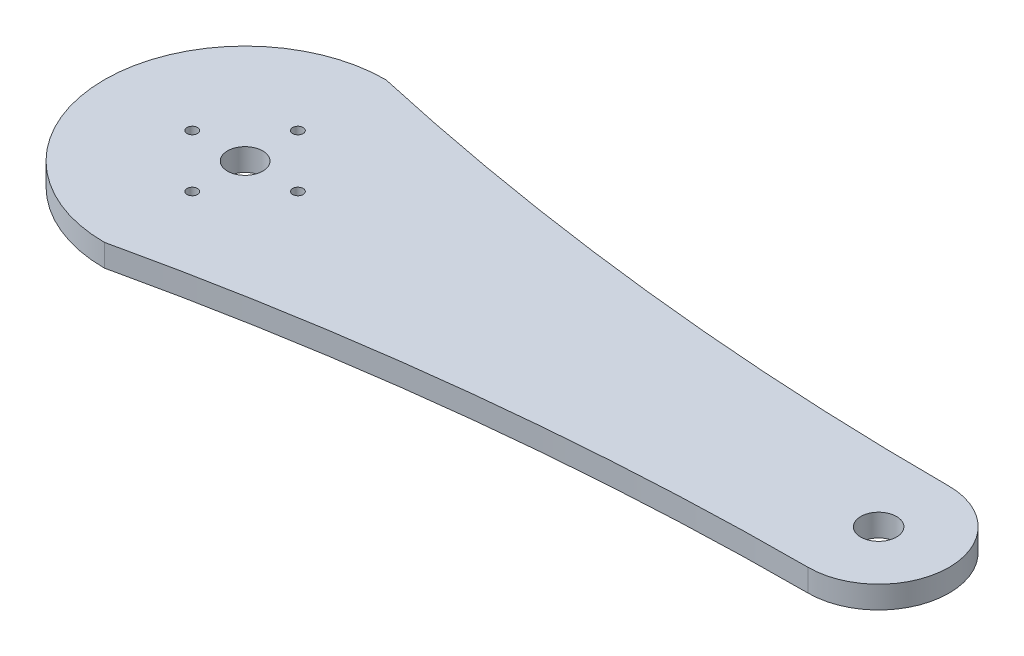
ISO-10303-21;
HEADER;
FILE_DESCRIPTION(('STEP AP214'),'2;1');
FILE_NAME('part.step','',(''),(''),'','','');
FILE_SCHEMA(('AUTOMOTIVE_DESIGN { 1 0 10303 214 1 1 1 1 }'));
ENDSEC;
DATA;
#1=APPLICATION_CONTEXT('core data for automotive mechanical design processes');
#2=APPLICATION_PROTOCOL_DEFINITION('international standard','automotive_design',2000,#1);
#3=PRODUCT_CONTEXT('',#1,'mechanical');
#4=PRODUCT('Part','Part','',(#3));
#5=PRODUCT_RELATED_PRODUCT_CATEGORY('part','',(#4));
#6=PRODUCT_DEFINITION_FORMATION('','',#4);
#7=PRODUCT_DEFINITION_CONTEXT('part definition',#1,'design');
#8=PRODUCT_DEFINITION('design','',#6,#7);
#9=PRODUCT_DEFINITION_SHAPE('','',#8);
#10=(LENGTH_UNIT() NAMED_UNIT(*) SI_UNIT(.MILLI.,.METRE.));
#11=(NAMED_UNIT(*) PLANE_ANGLE_UNIT() SI_UNIT($,.RADIAN.));
#12=(NAMED_UNIT(*) SI_UNIT($,.STERADIAN.) SOLID_ANGLE_UNIT());
#13=UNCERTAINTY_MEASURE_WITH_UNIT(LENGTH_MEASURE(1.E-05),#10,'distance_accuracy_value','');
#14=(GEOMETRIC_REPRESENTATION_CONTEXT(3) GLOBAL_UNCERTAINTY_ASSIGNED_CONTEXT((#13)) GLOBAL_UNIT_ASSIGNED_CONTEXT((#10,
#11,#12)) REPRESENTATION_CONTEXT('',''));
#15=CARTESIAN_POINT('',(0.,0.,0.));
#16=DIRECTION('',(0.,0.,1.));
#17=DIRECTION('',(1.,0.,0.));
#18=AXIS2_PLACEMENT_3D('',#15,#16,#17);
#19=CARTESIAN_POINT('',(4.627736357,3.175,-210.));
#20=DIRECTION('',(0.,-1.,0.));
#21=DIRECTION('',(0.,0.,-1.));
#22=AXIS2_PLACEMENT_3D('',#19,#20,#21);
#23=PLANE('',#22);
#24=CARTESIAN_POINT('',(49.627736357,3.175,0.));
#25=DIRECTION('',(0.,1.,0.));
#26=DIRECTION('',(0.,0.,1.));
#27=AXIS2_PLACEMENT_3D('',#24,#25,#26);
#28=CIRCLE('',#27,2.54);
#29=CARTESIAN_POINT('',(49.627736357,3.175,2.54));
#30=VERTEX_POINT('',#29);
#31=EDGE_CURVE('E173',#30,#30,#28,.T.);
#32=ORIENTED_EDGE('',*,*,#31,.F.);
#33=EDGE_LOOP('',(#32));
#34=FACE_BOUND('',#33,.T.);
#35=CARTESIAN_POINT('',(49.627736357,3.175,-420.));
#36=DIRECTION('',(0.,-1.,0.));
#37=DIRECTION('',(0.,0.,-1.));
#38=AXIS2_PLACEMENT_3D('',#35,#36,#37);
#39=CIRCLE('',#38,410.);
#40=CARTESIAN_POINT('',(49.627736357,3.175,-10.));
#41=VERTEX_POINT('',#40);
#42=CARTESIAN_POINT('',(-40.372263643,3.175,-20.));
#43=VERTEX_POINT('',#42);
#44=EDGE_CURVE('E11',#41,#43,#39,.T.);
#45=ORIENTED_EDGE('',*,*,#44,.T.);
#46=CARTESIAN_POINT('',(-40.372263643,3.175,0.));
#47=DIRECTION('',(0.,1.,0.));
#48=DIRECTION('',(0.,0.,1.));
#49=AXIS2_PLACEMENT_3D('',#46,#47,#48);
#50=CIRCLE('',#49,20.);
#51=CARTESIAN_POINT('',(-40.372263643,3.175,20.));
#52=VERTEX_POINT('',#51);
#53=EDGE_CURVE('E45',#43,#52,#50,.T.);
#54=ORIENTED_EDGE('',*,*,#53,.T.);
#55=CARTESIAN_POINT('',(49.627736357,3.175,420.));
#56=DIRECTION('',(0.,-1.,0.));
#57=DIRECTION('',(0.,0.,1.));
#58=AXIS2_PLACEMENT_3D('',#55,#56,#57);
#59=CIRCLE('',#58,410.);
#60=CARTESIAN_POINT('',(49.627736357,3.175,10.));
#61=VERTEX_POINT('',#60);
#62=EDGE_CURVE('E119',#52,#61,#59,.T.);
#63=ORIENTED_EDGE('',*,*,#62,.T.);
#64=CARTESIAN_POINT('',(49.627736357,3.175,0.));
#65=DIRECTION('',(0.,1.,0.));
#66=DIRECTION('',(0.,0.,-1.));
#67=AXIS2_PLACEMENT_3D('',#64,#65,#66);
#68=CIRCLE('',#67,10.);
#69=EDGE_CURVE('E117',#61,#41,#68,.T.);
#70=ORIENTED_EDGE('',*,*,#69,.T.);
#71=EDGE_LOOP('',(#45,#54,#63,#70));
#72=FACE_BOUND('',#71,.T.);
#73=CARTESIAN_POINT('',(-40.372263643,3.175,0.));
#74=DIRECTION('',(0.,-1.,0.));
#75=DIRECTION('',(0.,0.,1.));
#76=AXIS2_PLACEMENT_3D('',#73,#74,#75);
#77=CIRCLE('',#76,2.5);
#78=CARTESIAN_POINT('',(-40.372263643,3.175,2.5));
#79=VERTEX_POINT('',#78);
#80=EDGE_CURVE('E113',#79,#79,#77,.T.);
#81=ORIENTED_EDGE('',*,*,#80,.T.);
#82=EDGE_LOOP('',(#81));
#83=FACE_BOUND('',#82,.T.);
#84=CARTESIAN_POINT('',(-32.872263643,3.175,0.));
#85=DIRECTION('',(0.,-1.,0.));
#86=DIRECTION('',(0.,0.,1.));
#87=AXIS2_PLACEMENT_3D('',#84,#85,#86);
#88=CIRCLE('',#87,0.75);
#89=CARTESIAN_POINT('',(-32.872263643,3.175,0.75));
#90=VERTEX_POINT('',#89);
#91=EDGE_CURVE('E110',#90,#90,#88,.T.);
#92=ORIENTED_EDGE('',*,*,#91,.T.);
#93=EDGE_LOOP('',(#92));
#94=FACE_BOUND('',#93,.T.);
#95=CARTESIAN_POINT('',(-47.872263643,3.175,0.));
#96=DIRECTION('',(0.,-1.,0.));
#97=DIRECTION('',(0.,0.,1.));
#98=AXIS2_PLACEMENT_3D('',#95,#96,#97);
#99=CIRCLE('',#98,0.75);
#100=CARTESIAN_POINT('',(-47.872263643,3.175,0.75));
#101=VERTEX_POINT('',#100);
#102=EDGE_CURVE('E121',#101,#101,#99,.T.);
#103=ORIENTED_EDGE('',*,*,#102,.T.);
#104=EDGE_LOOP('',(#103));
#105=FACE_BOUND('',#104,.T.);
#106=CARTESIAN_POINT('',(-40.372263643,3.175,-7.5));
#107=DIRECTION('',(0.,-1.,0.));
#108=DIRECTION('',(0.,0.,1.));
#109=AXIS2_PLACEMENT_3D('',#106,#107,#108);
#110=CIRCLE('',#109,0.75);
#111=CARTESIAN_POINT('',(-40.372263643,3.175,-6.75));
#112=VERTEX_POINT('',#111);
#113=EDGE_CURVE('E134',#112,#112,#110,.T.);
#114=ORIENTED_EDGE('',*,*,#113,.T.);
#115=EDGE_LOOP('',(#114));
#116=FACE_BOUND('',#115,.T.);
#117=CARTESIAN_POINT('',(-40.372263643,3.175,7.5));
#118=DIRECTION('',(0.,-1.,0.));
#119=DIRECTION('',(0.,0.,1.));
#120=AXIS2_PLACEMENT_3D('',#117,#118,#119);
#121=CIRCLE('',#120,0.75);
#122=CARTESIAN_POINT('',(-40.372263643,3.175,8.25));
#123=VERTEX_POINT('',#122);
#124=EDGE_CURVE('E131',#123,#123,#121,.T.);
#125=ORIENTED_EDGE('',*,*,#124,.T.);
#126=EDGE_LOOP('',(#125));
#127=FACE_BOUND('',#126,.T.);
#128=ADVANCED_FACE('F36',(#34,#72,#83,#94,#105,#116,#127),#23,.F.);
#129=CARTESIAN_POINT('',(4.627736357,0.,-210.));
#130=DIRECTION('',(0.,-1.,0.));
#131=DIRECTION('',(0.,0.,-1.));
#132=AXIS2_PLACEMENT_3D('',#129,#130,#131);
#133=PLANE('',#132);
#134=CARTESIAN_POINT('',(49.627736357,0.,0.));
#135=DIRECTION('',(0.,-1.,0.));
#136=DIRECTION('',(0.,0.,-1.));
#137=AXIS2_PLACEMENT_3D('',#134,#135,#136);
#138=CIRCLE('',#137,2.54);
#139=CARTESIAN_POINT('',(49.627736357,0.,-2.54));
#140=VERTEX_POINT('',#139);
#141=EDGE_CURVE('E220',#140,#140,#138,.F.);
#142=ORIENTED_EDGE('',*,*,#141,.T.);
#143=EDGE_LOOP('',(#142));
#144=FACE_BOUND('',#143,.T.);
#145=CARTESIAN_POINT('',(-40.372263643,0.,-7.5));
#146=DIRECTION('',(0.,1.,0.));
#147=DIRECTION('',(0.,0.,1.));
#148=AXIS2_PLACEMENT_3D('',#145,#146,#147);
#149=CIRCLE('',#148,0.75);
#150=CARTESIAN_POINT('',(-40.372263643,0.,-6.75));
#151=VERTEX_POINT('',#150);
#152=EDGE_CURVE('E135',#151,#151,#149,.T.);
#153=ORIENTED_EDGE('',*,*,#152,.T.);
#154=EDGE_LOOP('',(#153));
#155=FACE_BOUND('',#154,.T.);
#156=CARTESIAN_POINT('',(-32.872263643,0.,0.));
#157=DIRECTION('',(0.,1.,0.));
#158=DIRECTION('',(0.,0.,1.));
#159=AXIS2_PLACEMENT_3D('',#156,#157,#158);
#160=CIRCLE('',#159,0.75);
#161=CARTESIAN_POINT('',(-32.872263643,0.,0.75));
#162=VERTEX_POINT('',#161);
#163=EDGE_CURVE('E178',#162,#162,#160,.T.);
#164=ORIENTED_EDGE('',*,*,#163,.T.);
#165=EDGE_LOOP('',(#164));
#166=FACE_BOUND('',#165,.T.);
#167=CARTESIAN_POINT('',(49.627736357,0.,-420.));
#168=DIRECTION('',(0.,1.,0.));
#169=DIRECTION('',(0.,0.,-1.));
#170=AXIS2_PLACEMENT_3D('',#167,#168,#169);
#171=CIRCLE('',#170,410.);
#172=CARTESIAN_POINT('',(-40.372263643,0.,-20.));
#173=VERTEX_POINT('',#172);
#174=CARTESIAN_POINT('',(49.627736357,0.,-10.));
#175=VERTEX_POINT('',#174);
#176=EDGE_CURVE('E130',#173,#175,#171,.T.);
#177=ORIENTED_EDGE('',*,*,#176,.T.);
#178=CARTESIAN_POINT('',(49.627736357,0.,0.));
#179=DIRECTION('',(0.,-1.,0.));
#180=DIRECTION('',(0.,0.,-1.));
#181=AXIS2_PLACEMENT_3D('',#178,#179,#180);
#182=CIRCLE('',#181,10.);
#183=CARTESIAN_POINT('',(49.627736357,0.,10.));
#184=VERTEX_POINT('',#183);
#185=EDGE_CURVE('E127',#175,#184,#182,.T.);
#186=ORIENTED_EDGE('',*,*,#185,.T.);
#187=CARTESIAN_POINT('',(49.627736357,0.,420.));
#188=DIRECTION('',(0.,1.,0.));
#189=DIRECTION('',(0.,0.,1.));
#190=AXIS2_PLACEMENT_3D('',#187,#188,#189);
#191=CIRCLE('',#190,410.);
#192=CARTESIAN_POINT('',(-40.372263643,0.,20.));
#193=VERTEX_POINT('',#192);
#194=EDGE_CURVE('E125',#184,#193,#191,.T.);
#195=ORIENTED_EDGE('',*,*,#194,.T.);
#196=CARTESIAN_POINT('',(-40.372263643,0.,0.));
#197=DIRECTION('',(0.,-1.,0.));
#198=DIRECTION('',(0.,0.,1.));
#199=AXIS2_PLACEMENT_3D('',#196,#197,#198);
#200=CIRCLE('',#199,20.);
#201=EDGE_CURVE('E92',#193,#173,#200,.T.);
#202=ORIENTED_EDGE('',*,*,#201,.T.);
#203=EDGE_LOOP('',(#177,#186,#195,#202));
#204=FACE_BOUND('',#203,.T.);
#205=CARTESIAN_POINT('',(-40.372263643,0.,0.));
#206=DIRECTION('',(0.,1.,0.));
#207=DIRECTION('',(0.,0.,1.));
#208=AXIS2_PLACEMENT_3D('',#205,#206,#207);
#209=CIRCLE('',#208,2.5);
#210=CARTESIAN_POINT('',(-40.372263643,0.,2.5));
#211=VERTEX_POINT('',#210);
#212=EDGE_CURVE('E101',#211,#211,#209,.T.);
#213=ORIENTED_EDGE('',*,*,#212,.T.);
#214=EDGE_LOOP('',(#213));
#215=FACE_BOUND('',#214,.T.);
#216=CARTESIAN_POINT('',(-47.872263643,0.,0.));
#217=DIRECTION('',(0.,1.,0.));
#218=DIRECTION('',(0.,0.,1.));
#219=AXIS2_PLACEMENT_3D('',#216,#217,#218);
#220=CIRCLE('',#219,0.75);
#221=CARTESIAN_POINT('',(-47.872263643,0.,0.75));
#222=VERTEX_POINT('',#221);
#223=EDGE_CURVE('E147',#222,#222,#220,.T.);
#224=ORIENTED_EDGE('',*,*,#223,.T.);
#225=EDGE_LOOP('',(#224));
#226=FACE_BOUND('',#225,.T.);
#227=CARTESIAN_POINT('',(-40.372263643,0.,7.5));
#228=DIRECTION('',(0.,1.,0.));
#229=DIRECTION('',(0.,0.,1.));
#230=AXIS2_PLACEMENT_3D('',#227,#228,#229);
#231=CIRCLE('',#230,0.75);
#232=CARTESIAN_POINT('',(-40.372263643,0.,8.25));
#233=VERTEX_POINT('',#232);
#234=EDGE_CURVE('E39',#233,#233,#231,.T.);
#235=ORIENTED_EDGE('',*,*,#234,.T.);
#236=EDGE_LOOP('',(#235));
#237=FACE_BOUND('',#236,.T.);
#238=ADVANCED_FACE('F180',(#144,#155,#166,#204,#215,#226,#237),#133,.T.);
#239=CARTESIAN_POINT('',(49.627736357,3.175,-420.));
#240=DIRECTION('',(0.,-1.,0.));
#241=DIRECTION('',(0.,0.,-1.));
#242=AXIS2_PLACEMENT_3D('',#239,#240,#241);
#243=CYLINDRICAL_SURFACE('',#242,410.);
#244=ORIENTED_EDGE('',*,*,#176,.F.);
#245=DIRECTION('',(0.,1.,0.));
#246=VECTOR('',#245,1.);
#247=CARTESIAN_POINT('',(-40.372263643,3.175,-20.));
#248=LINE('',#247,#246);
#249=EDGE_CURVE('E190',#173,#43,#248,.T.);
#250=ORIENTED_EDGE('',*,*,#249,.T.);
#251=ORIENTED_EDGE('',*,*,#44,.F.);
#252=DIRECTION('',(0.,-1.,0.));
#253=VECTOR('',#252,1.);
#254=CARTESIAN_POINT('',(49.627736357,3.175,-10.));
#255=LINE('',#254,#253);
#256=EDGE_CURVE('E187',#41,#175,#255,.T.);
#257=ORIENTED_EDGE('',*,*,#256,.T.);
#258=EDGE_LOOP('',(#244,#250,#251,#257));
#259=FACE_BOUND('',#258,.T.);
#260=ADVANCED_FACE('F203',(#259),#243,.F.);
#261=CARTESIAN_POINT('',(-40.372263643,3.175,0.));
#262=DIRECTION('',(0.,-1.,0.));
#263=DIRECTION('',(0.,0.,-1.));
#264=AXIS2_PLACEMENT_3D('',#261,#262,#263);
#265=CYLINDRICAL_SURFACE('',#264,20.);
#266=ORIENTED_EDGE('',*,*,#201,.F.);
#267=DIRECTION('',(0.,1.,0.));
#268=VECTOR('',#267,1.);
#269=CARTESIAN_POINT('',(-40.372263643,3.175,20.));
#270=LINE('',#269,#268);
#271=EDGE_CURVE('E159',#193,#52,#270,.T.);
#272=ORIENTED_EDGE('',*,*,#271,.T.);
#273=ORIENTED_EDGE('',*,*,#53,.F.);
#274=ORIENTED_EDGE('',*,*,#249,.F.);
#275=EDGE_LOOP('',(#266,#272,#273,#274));
#276=FACE_BOUND('',#275,.T.);
#277=ADVANCED_FACE('F237',(#276),#265,.T.);
#278=CARTESIAN_POINT('',(49.627736357,3.175,420.));
#279=DIRECTION('',(0.,-1.,0.));
#280=DIRECTION('',(0.,0.,-1.));
#281=AXIS2_PLACEMENT_3D('',#278,#279,#280);
#282=CYLINDRICAL_SURFACE('',#281,410.);
#283=ORIENTED_EDGE('',*,*,#194,.F.);
#284=DIRECTION('',(0.,1.,0.));
#285=VECTOR('',#284,1.);
#286=CARTESIAN_POINT('',(49.627736357,3.175,10.));
#287=LINE('',#286,#285);
#288=EDGE_CURVE('E153',#184,#61,#287,.T.);
#289=ORIENTED_EDGE('',*,*,#288,.T.);
#290=ORIENTED_EDGE('',*,*,#62,.F.);
#291=ORIENTED_EDGE('',*,*,#271,.F.);
#292=EDGE_LOOP('',(#283,#289,#290,#291));
#293=FACE_BOUND('',#292,.T.);
#294=ADVANCED_FACE('F185',(#293),#282,.F.);
#295=CARTESIAN_POINT('',(49.627736357,3.175,0.));
#296=DIRECTION('',(0.,-1.,0.));
#297=DIRECTION('',(0.,0.,-1.));
#298=AXIS2_PLACEMENT_3D('',#295,#296,#297);
#299=CYLINDRICAL_SURFACE('',#298,10.);
#300=ORIENTED_EDGE('',*,*,#185,.F.);
#301=ORIENTED_EDGE('',*,*,#256,.F.);
#302=ORIENTED_EDGE('',*,*,#69,.F.);
#303=ORIENTED_EDGE('',*,*,#288,.F.);
#304=EDGE_LOOP('',(#300,#301,#302,#303));
#305=FACE_BOUND('',#304,.T.);
#306=ADVANCED_FACE('F200',(#305),#299,.T.);
#307=CARTESIAN_POINT('',(-40.372263643,3.175,0.));
#308=DIRECTION('',(0.,-1.,0.));
#309=DIRECTION('',(0.,0.,-1.));
#310=AXIS2_PLACEMENT_3D('',#307,#308,#309);
#311=CYLINDRICAL_SURFACE('',#310,2.5);
#312=CARTESIAN_POINT('',(-40.372263643,0.,2.5));
#313=CARTESIAN_POINT('',(-40.372263643,3.175,2.5));
#314=(BOUNDED_CURVE() B_SPLINE_CURVE(1,(#312,#313),.UNSPECIFIED.,.F.,
.F.) B_SPLINE_CURVE_WITH_KNOTS((2,2),(-3.175,0.),
.UNSPECIFIED.) CURVE() GEOMETRIC_REPRESENTATION_ITEM() RATIONAL_B_SPLINE_CURVE((1.,1.)) REPRESENTATION_ITEM(''));
#315=EDGE_CURVE('E115',#211,#79,#314,.T.);
#316=ORIENTED_EDGE('',*,*,#315,.F.);
#317=ORIENTED_EDGE('',*,*,#212,.F.);
#318=ORIENTED_EDGE('',*,*,#315,.T.);
#319=ORIENTED_EDGE('',*,*,#80,.F.);
#320=EDGE_LOOP('',(#316,#317,#318,#319));
#321=FACE_BOUND('',#320,.T.);
#322=ADVANCED_FACE('F114',(#321),#311,.F.);
#323=CARTESIAN_POINT('',(-32.872263643,3.175,0.));
#324=DIRECTION('',(0.,-1.,0.));
#325=DIRECTION('',(0.,0.,-1.));
#326=AXIS2_PLACEMENT_3D('',#323,#324,#325);
#327=CYLINDRICAL_SURFACE('',#326,0.75);
#328=CARTESIAN_POINT('',(-32.872263643,0.,0.75));
#329=CARTESIAN_POINT('',(-32.872263643,3.175,0.75));
#330=(BOUNDED_CURVE() B_SPLINE_CURVE(1,(#328,#329),.UNSPECIFIED.,.F.,
.F.) B_SPLINE_CURVE_WITH_KNOTS((2,2),(-3.175,0.),
.UNSPECIFIED.) CURVE() GEOMETRIC_REPRESENTATION_ITEM() RATIONAL_B_SPLINE_CURVE((1.,1.)) REPRESENTATION_ITEM(''));
#331=EDGE_CURVE('E152',#162,#90,#330,.T.);
#332=ORIENTED_EDGE('',*,*,#331,.F.);
#333=ORIENTED_EDGE('',*,*,#163,.F.);
#334=ORIENTED_EDGE('',*,*,#331,.T.);
#335=ORIENTED_EDGE('',*,*,#91,.F.);
#336=EDGE_LOOP('',(#332,#333,#334,#335));
#337=FACE_BOUND('',#336,.T.);
#338=ADVANCED_FACE('F214',(#337),#327,.F.);
#339=CARTESIAN_POINT('',(-47.872263643,3.175,0.));
#340=DIRECTION('',(0.,-1.,0.));
#341=DIRECTION('',(0.,0.,-1.));
#342=AXIS2_PLACEMENT_3D('',#339,#340,#341);
#343=CYLINDRICAL_SURFACE('',#342,0.75);
#344=CARTESIAN_POINT('',(-47.872263643,0.,0.75));
#345=CARTESIAN_POINT('',(-47.872263643,3.175,0.75));
#346=(BOUNDED_CURVE() B_SPLINE_CURVE(1,(#344,#345),.UNSPECIFIED.,.F.,
.F.) B_SPLINE_CURVE_WITH_KNOTS((2,2),(-3.175,0.),
.UNSPECIFIED.) CURVE() GEOMETRIC_REPRESENTATION_ITEM() RATIONAL_B_SPLINE_CURVE((1.,1.)) REPRESENTATION_ITEM(''));
#347=EDGE_CURVE('E141',#222,#101,#346,.T.);
#348=ORIENTED_EDGE('',*,*,#347,.F.);
#349=ORIENTED_EDGE('',*,*,#223,.F.);
#350=ORIENTED_EDGE('',*,*,#347,.T.);
#351=ORIENTED_EDGE('',*,*,#102,.F.);
#352=EDGE_LOOP('',(#348,#349,#350,#351));
#353=FACE_BOUND('',#352,.T.);
#354=ADVANCED_FACE('F246',(#353),#343,.F.);
#355=CARTESIAN_POINT('',(-40.372263643,3.175,-7.5));
#356=DIRECTION('',(0.,-1.,0.));
#357=DIRECTION('',(0.,0.,-1.));
#358=AXIS2_PLACEMENT_3D('',#355,#356,#357);
#359=CYLINDRICAL_SURFACE('',#358,0.75);
#360=CARTESIAN_POINT('',(-40.372263643,0.,-6.75));
#361=CARTESIAN_POINT('',(-40.372263643,3.175,-6.75));
#362=(BOUNDED_CURVE() B_SPLINE_CURVE(1,(#360,#361),.UNSPECIFIED.,.F.,
.F.) B_SPLINE_CURVE_WITH_KNOTS((2,2),(-3.175,0.),
.UNSPECIFIED.) CURVE() GEOMETRIC_REPRESENTATION_ITEM() RATIONAL_B_SPLINE_CURVE((1.,1.)) REPRESENTATION_ITEM(''));
#363=EDGE_CURVE('E136',#151,#112,#362,.T.);
#364=ORIENTED_EDGE('',*,*,#363,.F.);
#365=ORIENTED_EDGE('',*,*,#152,.F.);
#366=ORIENTED_EDGE('',*,*,#363,.T.);
#367=ORIENTED_EDGE('',*,*,#113,.F.);
#368=EDGE_LOOP('',(#364,#365,#366,#367));
#369=FACE_BOUND('',#368,.T.);
#370=ADVANCED_FACE('F243',(#369),#359,.F.);
#371=CARTESIAN_POINT('',(-40.372263643,3.175,7.5));
#372=DIRECTION('',(0.,-1.,0.));
#373=DIRECTION('',(0.,0.,-1.));
#374=AXIS2_PLACEMENT_3D('',#371,#372,#373);
#375=CYLINDRICAL_SURFACE('',#374,0.75);
#376=CARTESIAN_POINT('',(-40.372263643,0.,8.25));
#377=CARTESIAN_POINT('',(-40.372263643,3.175,8.25));
#378=(BOUNDED_CURVE() B_SPLINE_CURVE(1,(#376,#377),.UNSPECIFIED.,.F.,
.F.) B_SPLINE_CURVE_WITH_KNOTS((2,2),(-3.175,0.),
.UNSPECIFIED.) CURVE() GEOMETRIC_REPRESENTATION_ITEM() RATIONAL_B_SPLINE_CURVE((1.,1.)) REPRESENTATION_ITEM(''));
#379=EDGE_CURVE('E142',#233,#123,#378,.T.);
#380=ORIENTED_EDGE('',*,*,#379,.F.);
#381=ORIENTED_EDGE('',*,*,#234,.F.);
#382=ORIENTED_EDGE('',*,*,#379,.T.);
#383=ORIENTED_EDGE('',*,*,#124,.F.);
#384=EDGE_LOOP('',(#380,#381,#382,#383));
#385=FACE_BOUND('',#384,.T.);
#386=ADVANCED_FACE('F241',(#385),#375,.F.);
#387=CARTESIAN_POINT('',(49.627736357,-0.00100000000000013,0.));
#388=DIRECTION('',(0.,1.,0.));
#389=DIRECTION('',(0.,0.,1.));
#390=AXIS2_PLACEMENT_3D('',#387,#388,#389);
#391=CYLINDRICAL_SURFACE('',#390,2.54);
#392=ORIENTED_EDGE('',*,*,#141,.F.);
#393=EDGE_LOOP('',(#392));
#394=FACE_BOUND('',#393,.T.);
#395=ORIENTED_EDGE('',*,*,#31,.T.);
#396=EDGE_LOOP('',(#395));
#397=FACE_BOUND('',#396,.T.);
#398=ADVANCED_FACE('F226',(#394,#397),#391,.F.);
#399=CLOSED_SHELL('',(#128,#238,#260,#277,#294,#306,#322,#338,#354,#370,#386,#398));
#400=MANIFOLD_SOLID_BREP('B2',#399);
#401=ADVANCED_BREP_SHAPE_REPRESENTATION('',(#18,#400),#14);
#402=SHAPE_DEFINITION_REPRESENTATION(#9,#401);
ENDSEC;
END-ISO-10303-21;
